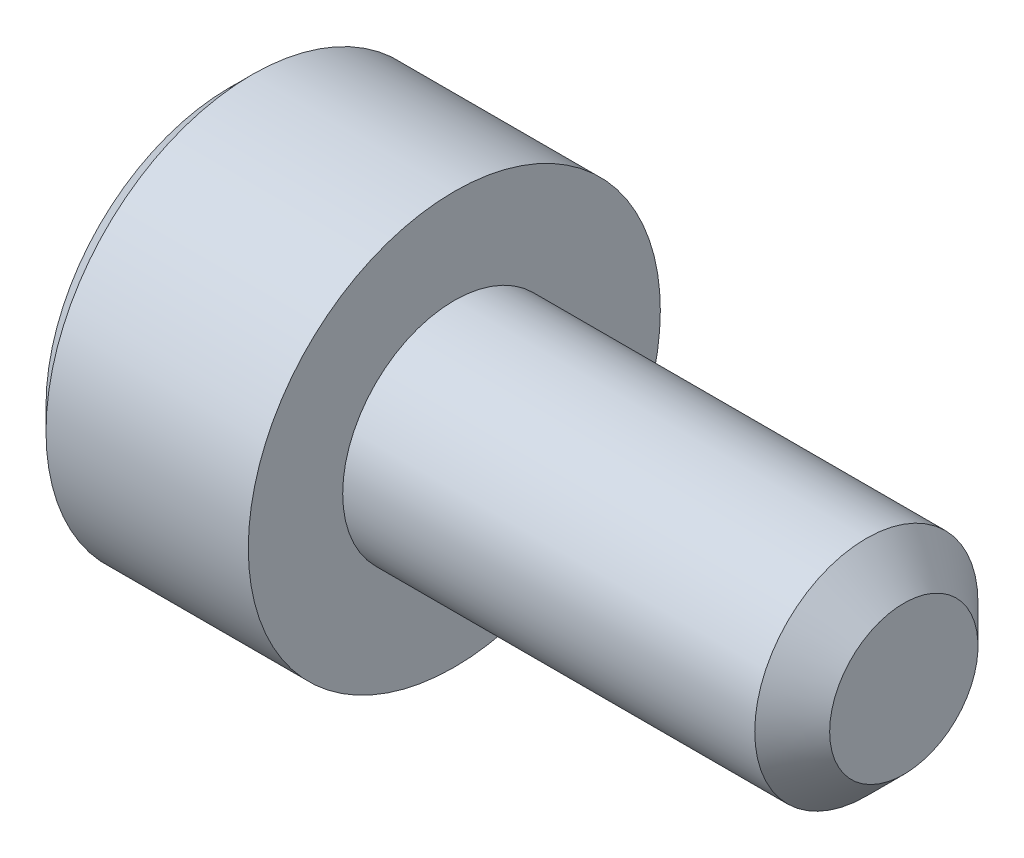
ISO-10303-21;
HEADER;
FILE_DESCRIPTION(('STEP AP214'),'2;1');
FILE_NAME('part.step','',(''),(''),'','','');
FILE_SCHEMA(('AUTOMOTIVE_DESIGN { 1 0 10303 214 1 1 1 1 }'));
ENDSEC;
DATA;
#1=APPLICATION_CONTEXT('core data for automotive mechanical design processes');
#2=APPLICATION_PROTOCOL_DEFINITION('international standard','automotive_design',2000,#1);
#3=PRODUCT_CONTEXT('',#1,'mechanical');
#4=PRODUCT('Part','Part','',(#3));
#5=PRODUCT_RELATED_PRODUCT_CATEGORY('part','',(#4));
#6=PRODUCT_DEFINITION_FORMATION('','',#4);
#7=PRODUCT_DEFINITION_CONTEXT('part definition',#1,'design');
#8=PRODUCT_DEFINITION('design','',#6,#7);
#9=PRODUCT_DEFINITION_SHAPE('','',#8);
#10=(LENGTH_UNIT() NAMED_UNIT(*) SI_UNIT(.MILLI.,.METRE.));
#11=(NAMED_UNIT(*) PLANE_ANGLE_UNIT() SI_UNIT($,.RADIAN.));
#12=(NAMED_UNIT(*) SI_UNIT($,.STERADIAN.) SOLID_ANGLE_UNIT());
#13=UNCERTAINTY_MEASURE_WITH_UNIT(LENGTH_MEASURE(1.E-05),#10,'distance_accuracy_value','');
#14=(GEOMETRIC_REPRESENTATION_CONTEXT(3) GLOBAL_UNCERTAINTY_ASSIGNED_CONTEXT((#13)) GLOBAL_UNIT_ASSIGNED_CONTEXT((#10,
#11,#12)) REPRESENTATION_CONTEXT('',''));
#15=CARTESIAN_POINT('',(0.,0.,0.));
#16=DIRECTION('',(0.,0.,1.));
#17=DIRECTION('',(1.,0.,0.));
#18=AXIS2_PLACEMENT_3D('',#15,#16,#17);
#19=CARTESIAN_POINT('',(0.,0.,0.));
#20=DIRECTION('',(1.,0.,0.));
#21=DIRECTION('',(0.,0.,-1.));
#22=AXIS2_PLACEMENT_3D('',#19,#20,#21);
#23=PLANE('',#22);
#24=DIRECTION('',(0.,0.866025403784439,0.5));
#25=VECTOR('',#24,1.);
#26=CARTESIAN_POINT('',(0.,1.4,-0.981495457622362));
#27=LINE('',#26,#25);
#28=CARTESIAN_POINT('',(0.,0.,-1.78978583448784));
#29=VERTEX_POINT('',#28);
#30=CARTESIAN_POINT('',(0.,1.55,-0.894892917243918));
#31=VERTEX_POINT('',#30);
#32=EDGE_CURVE('E171',#29,#31,#27,.T.);
#33=ORIENTED_EDGE('',*,*,#32,.T.);
#34=DIRECTION('',(0.,0.,1.));
#35=VECTOR('',#34,1.);
#36=CARTESIAN_POINT('',(0.,1.55,0.721687836487032));
#37=LINE('',#36,#35);
#38=CARTESIAN_POINT('',(0.,1.55,0.894892917243919));
#39=VERTEX_POINT('',#38);
#40=EDGE_CURVE('E186',#31,#39,#37,.T.);
#41=ORIENTED_EDGE('',*,*,#40,.T.);
#42=DIRECTION('',(0.,-0.866025403784439,0.5));
#43=VECTOR('',#42,1.);
#44=CARTESIAN_POINT('',(0.,0.15,1.7031832941094));
#45=LINE('',#44,#43);
#46=CARTESIAN_POINT('',(0.,0.,1.78978583448784));
#47=VERTEX_POINT('',#46);
#48=EDGE_CURVE('E183',#39,#47,#45,.T.);
#49=ORIENTED_EDGE('',*,*,#48,.T.);
#50=DIRECTION('',(0.,-0.866025403784439,-0.5));
#51=VECTOR('',#50,1.);
#52=CARTESIAN_POINT('',(0.,-1.4,0.981495457622364));
#53=LINE('',#52,#51);
#54=CARTESIAN_POINT('',(0.,-1.55,0.89489291724392));
#55=VERTEX_POINT('',#54);
#56=EDGE_CURVE('E180',#47,#55,#53,.T.);
#57=ORIENTED_EDGE('',*,*,#56,.T.);
#58=DIRECTION('',(0.,0.,-1.));
#59=VECTOR('',#58,1.);
#60=CARTESIAN_POINT('',(0.,-1.55,-0.721687836487031));
#61=LINE('',#60,#59);
#62=CARTESIAN_POINT('',(0.,-1.55,-0.894892917243919));
#63=VERTEX_POINT('',#62);
#64=EDGE_CURVE('E177',#55,#63,#61,.T.);
#65=ORIENTED_EDGE('',*,*,#64,.T.);
#66=DIRECTION('',(0.,0.866025403784439,-0.5));
#67=VECTOR('',#66,1.);
#68=CARTESIAN_POINT('',(0.,-0.149999999999999,-1.7031832941094));
#69=LINE('',#68,#67);
#70=EDGE_CURVE('E174',#63,#29,#69,.T.);
#71=ORIENTED_EDGE('',*,*,#70,.T.);
#72=EDGE_LOOP('',(#33,#41,#49,#57,#65,#71));
#73=FACE_BOUND('',#72,.T.);
#74=CARTESIAN_POINT('',(0.,0.,0.));
#75=DIRECTION('',(1.,0.,0.));
#76=DIRECTION('',(0.,0.,-1.));
#77=AXIS2_PLACEMENT_3D('',#74,#75,#76);
#78=CIRCLE('',#77,2.44999999999999);
#79=CARTESIAN_POINT('',(0.,0.,-2.44999999999999));
#80=VERTEX_POINT('',#79);
#81=EDGE_CURVE('E163',#80,#80,#78,.F.);
#82=ORIENTED_EDGE('',*,*,#81,.T.);
#83=EDGE_LOOP('',(#82));
#84=FACE_BOUND('',#83,.T.);
#85=ADVANCED_FACE('F39',(#73,#84),#23,.F.);
#86=CARTESIAN_POINT('',(9.,0.,0.));
#87=DIRECTION('',(-1.,0.,0.));
#88=DIRECTION('',(0.,0.,1.));
#89=AXIS2_PLACEMENT_3D('',#86,#87,#88);
#90=PLANE('',#89);
#91=CARTESIAN_POINT('',(9.,0.,0.));
#92=DIRECTION('',(-1.,0.,0.));
#93=DIRECTION('',(0.,0.,1.));
#94=AXIS2_PLACEMENT_3D('',#91,#92,#93);
#95=CIRCLE('',#94,0.990000000000009);
#96=CARTESIAN_POINT('',(9.,0.,0.990000000000009));
#97=VERTEX_POINT('',#96);
#98=EDGE_CURVE('E159',#97,#97,#95,.F.);
#99=ORIENTED_EDGE('',*,*,#98,.T.);
#100=EDGE_LOOP('',(#99));
#101=FACE_BOUND('',#100,.T.);
#102=ADVANCED_FACE('F286',(#101),#90,.F.);
#103=CARTESIAN_POINT('',(-88.7054908485857,0.,0.));
#104=DIRECTION('',(-1.,0.,0.));
#105=DIRECTION('',(0.,0.,1.));
#106=AXIS2_PLACEMENT_3D('',#103,#104,#105);
#107=CYLINDRICAL_SURFACE('',#106,1.49);
#108=CARTESIAN_POINT('',(8.50000000000001,0.,0.));
#109=DIRECTION('',(-1.,0.,0.));
#110=DIRECTION('',(0.,0.,1.));
#111=AXIS2_PLACEMENT_3D('',#108,#109,#110);
#112=CIRCLE('',#111,1.49);
#113=CARTESIAN_POINT('',(8.50000000000001,0.,1.49));
#114=VERTEX_POINT('',#113);
#115=EDGE_CURVE('E155',#114,#114,#112,.T.);
#116=ORIENTED_EDGE('',*,*,#115,.T.);
#117=EDGE_LOOP('',(#116));
#118=FACE_BOUND('',#117,.T.);
#119=CARTESIAN_POINT('',(3.,0.,0.));
#120=DIRECTION('',(-1.,0.,0.));
#121=DIRECTION('',(0.,0.,1.));
#122=AXIS2_PLACEMENT_3D('',#119,#120,#121);
#123=CIRCLE('',#122,1.49);
#124=CARTESIAN_POINT('',(3.,0.,1.49));
#125=VERTEX_POINT('',#124);
#126=EDGE_CURVE('E146',#125,#125,#123,.T.);
#127=ORIENTED_EDGE('',*,*,#126,.F.);
#128=EDGE_LOOP('',(#127));
#129=FACE_BOUND('',#128,.T.);
#130=ADVANCED_FACE('F291',(#118,#129),#107,.T.);
#131=CARTESIAN_POINT('',(3.,1.49,0.));
#132=DIRECTION('',(-1.,0.,0.));
#133=DIRECTION('',(0.,0.,1.));
#134=AXIS2_PLACEMENT_3D('',#131,#132,#133);
#135=PLANE('',#134);
#136=CARTESIAN_POINT('',(3.,0.,0.));
#137=DIRECTION('',(-1.,0.,0.));
#138=DIRECTION('',(0.,0.,1.));
#139=AXIS2_PLACEMENT_3D('',#136,#137,#138);
#140=CIRCLE('',#139,2.75);
#141=CARTESIAN_POINT('',(3.,0.,2.75));
#142=VERTEX_POINT('',#141);
#143=EDGE_CURVE('E140',#142,#142,#140,.T.);
#144=ORIENTED_EDGE('',*,*,#143,.F.);
#145=EDGE_LOOP('',(#144));
#146=FACE_BOUND('',#145,.T.);
#147=ORIENTED_EDGE('',*,*,#126,.T.);
#148=EDGE_LOOP('',(#147));
#149=FACE_BOUND('',#148,.T.);
#150=ADVANCED_FACE('F301',(#146,#149),#135,.F.);
#151=CARTESIAN_POINT('',(-88.7054908485857,0.,0.));
#152=DIRECTION('',(-1.,0.,0.));
#153=DIRECTION('',(0.,0.,1.));
#154=AXIS2_PLACEMENT_3D('',#151,#152,#153);
#155=CYLINDRICAL_SURFACE('',#154,2.75);
#156=CARTESIAN_POINT('',(0.300000000000009,0.,0.));
#157=DIRECTION('',(1.,0.,0.));
#158=DIRECTION('',(0.,0.,-1.));
#159=AXIS2_PLACEMENT_3D('',#156,#157,#158);
#160=CIRCLE('',#159,2.75);
#161=CARTESIAN_POINT('',(0.300000000000009,0.,-2.75));
#162=VERTEX_POINT('',#161);
#163=EDGE_CURVE('E167',#162,#162,#160,.T.);
#164=ORIENTED_EDGE('',*,*,#163,.T.);
#165=EDGE_LOOP('',(#164));
#166=FACE_BOUND('',#165,.T.);
#167=ORIENTED_EDGE('',*,*,#143,.T.);
#168=EDGE_LOOP('',(#167));
#169=FACE_BOUND('',#168,.T.);
#170=ADVANCED_FACE('F297',(#166,#169),#155,.T.);
#171=CARTESIAN_POINT('',(8.50000000000001,0.,0.));
#172=DIRECTION('',(-1.,0.,0.));
#173=DIRECTION('',(0.,0.,1.));
#174=AXIS2_PLACEMENT_3D('',#171,#172,#173);
#175=CONICAL_SURFACE('',#174,1.49,0.785398163397444);
#176=ORIENTED_EDGE('',*,*,#98,.F.);
#177=EDGE_LOOP('',(#176));
#178=FACE_BOUND('',#177,.T.);
#179=ORIENTED_EDGE('',*,*,#115,.F.);
#180=EDGE_LOOP('',(#179));
#181=FACE_BOUND('',#180,.T.);
#182=ADVANCED_FACE('F300',(#178,#181),#175,.T.);
#183=CARTESIAN_POINT('',(0.,0.,0.));
#184=DIRECTION('',(1.,0.,0.));
#185=DIRECTION('',(0.,0.,-1.));
#186=AXIS2_PLACEMENT_3D('',#183,#184,#185);
#187=CONICAL_SURFACE('',#186,2.44999999999999,0.785398163397444);
#188=ORIENTED_EDGE('',*,*,#163,.F.);
#189=EDGE_LOOP('',(#188));
#190=FACE_BOUND('',#189,.T.);
#191=ORIENTED_EDGE('',*,*,#81,.F.);
#192=EDGE_LOOP('',(#191));
#193=FACE_BOUND('',#192,.T.);
#194=ADVANCED_FACE('F311',(#190,#193),#187,.T.);
#195=CARTESIAN_POINT('',(2.5,1.25,0.721687836487032));
#196=DIRECTION('',(0.,-0.5,-0.866025403784438));
#197=DIRECTION('',(0.,0.866025403784439,-0.5));
#198=AXIS2_PLACEMENT_3D('',#195,#196,#197);
#199=PLANE('',#198);
#200=DIRECTION('',(-1.,0.,0.));
#201=VECTOR('',#200,1.);
#202=CARTESIAN_POINT('',(2.5,0.,1.44337567297407));
#203=LINE('',#202,#201);
#204=CARTESIAN_POINT('',(2.5,0.,1.44337567297407));
#205=VERTEX_POINT('',#204);
#206=CARTESIAN_POINT('',(0.3,0.,1.44337567297407));
#207=VERTEX_POINT('',#206);
#208=EDGE_CURVE('E130',#205,#207,#203,.T.);
#209=ORIENTED_EDGE('',*,*,#208,.T.);
#210=DIRECTION('',(0.,0.866025403784439,-0.5));
#211=VECTOR('',#210,1.);
#212=CARTESIAN_POINT('',(0.3,1.25,0.721687836487032));
#213=LINE('',#212,#211);
#214=CARTESIAN_POINT('',(0.3,1.25,0.721687836487032));
#215=VERTEX_POINT('',#214);
#216=EDGE_CURVE('E194',#207,#215,#213,.T.);
#217=ORIENTED_EDGE('',*,*,#216,.T.);
#218=DIRECTION('',(-1.,0.,0.));
#219=VECTOR('',#218,1.);
#220=CARTESIAN_POINT('',(2.5,1.25,0.721687836487032));
#221=LINE('',#220,#219);
#222=CARTESIAN_POINT('',(2.5,1.25,0.721687836487032));
#223=VERTEX_POINT('',#222);
#224=EDGE_CURVE('E133',#223,#215,#221,.T.);
#225=ORIENTED_EDGE('',*,*,#224,.F.);
#226=DIRECTION('',(0.,-0.866025403784439,0.5));
#227=VECTOR('',#226,1.);
#228=CARTESIAN_POINT('',(2.5,1.25,0.721687836487032));
#229=LINE('',#228,#227);
#230=EDGE_CURVE('E117',#223,#205,#229,.T.);
#231=ORIENTED_EDGE('',*,*,#230,.T.);
#232=EDGE_LOOP('',(#209,#217,#225,#231));
#233=FACE_BOUND('',#232,.T.);
#234=ADVANCED_FACE('F129',(#233),#199,.T.);
#235=CARTESIAN_POINT('',(2.5,0.,1.44337567297407));
#236=DIRECTION('',(0.,0.5,-0.866025403784438));
#237=DIRECTION('',(0.,0.866025403784439,0.5));
#238=AXIS2_PLACEMENT_3D('',#235,#236,#237);
#239=PLANE('',#238);
#240=DIRECTION('',(-1.,0.,0.));
#241=VECTOR('',#240,1.);
#242=CARTESIAN_POINT('',(2.5,-1.25,0.721687836487033));
#243=LINE('',#242,#241);
#244=CARTESIAN_POINT('',(2.5,-1.25,0.721687836487033));
#245=VERTEX_POINT('',#244);
#246=CARTESIAN_POINT('',(0.3,-1.25,0.721687836487033));
#247=VERTEX_POINT('',#246);
#248=EDGE_CURVE('E141',#245,#247,#243,.T.);
#249=ORIENTED_EDGE('',*,*,#248,.T.);
#250=DIRECTION('',(0.,0.866025403784439,0.5));
#251=VECTOR('',#250,1.);
#252=CARTESIAN_POINT('',(0.3,0.,1.44337567297407));
#253=LINE('',#252,#251);
#254=EDGE_CURVE('E138',#247,#207,#253,.T.);
#255=ORIENTED_EDGE('',*,*,#254,.T.);
#256=ORIENTED_EDGE('',*,*,#208,.F.);
#257=DIRECTION('',(0.,-0.866025403784439,-0.5));
#258=VECTOR('',#257,1.);
#259=CARTESIAN_POINT('',(2.5,0.,1.44337567297407));
#260=LINE('',#259,#258);
#261=EDGE_CURVE('E113',#205,#245,#260,.T.);
#262=ORIENTED_EDGE('',*,*,#261,.T.);
#263=EDGE_LOOP('',(#249,#255,#256,#262));
#264=FACE_BOUND('',#263,.T.);
#265=ADVANCED_FACE('F136',(#264),#239,.T.);
#266=CARTESIAN_POINT('',(2.5,-1.25,0.721687836487033));
#267=DIRECTION('',(0.,1.,0.));
#268=DIRECTION('',(0.,0.,1.));
#269=AXIS2_PLACEMENT_3D('',#266,#267,#268);
#270=PLANE('',#269);
#271=DIRECTION('',(-1.,0.,0.));
#272=VECTOR('',#271,1.);
#273=CARTESIAN_POINT('',(2.5,-1.25,-0.721687836487031));
#274=LINE('',#273,#272);
#275=CARTESIAN_POINT('',(2.5,-1.25,-0.721687836487031));
#276=VERTEX_POINT('',#275);
#277=CARTESIAN_POINT('',(0.3,-1.25,-0.721687836487031));
#278=VERTEX_POINT('',#277);
#279=EDGE_CURVE('E148',#276,#278,#274,.T.);
#280=ORIENTED_EDGE('',*,*,#279,.T.);
#281=DIRECTION('',(0.,0.,1.));
#282=VECTOR('',#281,1.);
#283=CARTESIAN_POINT('',(0.3,-1.25,0.721687836487033));
#284=LINE('',#283,#282);
#285=EDGE_CURVE('E199',#278,#247,#284,.T.);
#286=ORIENTED_EDGE('',*,*,#285,.T.);
#287=ORIENTED_EDGE('',*,*,#248,.F.);
#288=DIRECTION('',(0.,0.,-1.));
#289=VECTOR('',#288,1.);
#290=CARTESIAN_POINT('',(2.5,-1.25,0.721687836487033));
#291=LINE('',#290,#289);
#292=EDGE_CURVE('E119',#245,#276,#291,.T.);
#293=ORIENTED_EDGE('',*,*,#292,.T.);
#294=EDGE_LOOP('',(#280,#286,#287,#293));
#295=FACE_BOUND('',#294,.T.);
#296=ADVANCED_FACE('F234',(#295),#270,.T.);
#297=CARTESIAN_POINT('',(2.5,-1.25,-0.721687836487031));
#298=DIRECTION('',(0.,0.5,0.866025403784439));
#299=DIRECTION('',(0.,-0.866025403784439,0.5));
#300=AXIS2_PLACEMENT_3D('',#297,#298,#299);
#301=PLANE('',#300);
#302=DIRECTION('',(-1.,0.,0.));
#303=VECTOR('',#302,1.);
#304=CARTESIAN_POINT('',(2.5,0.,-1.44337567297406));
#305=LINE('',#304,#303);
#306=CARTESIAN_POINT('',(2.5,0.,-1.44337567297406));
#307=VERTEX_POINT('',#306);
#308=CARTESIAN_POINT('',(0.3,0.,-1.44337567297406));
#309=VERTEX_POINT('',#308);
#310=EDGE_CURVE('E236',#307,#309,#305,.T.);
#311=ORIENTED_EDGE('',*,*,#310,.T.);
#312=DIRECTION('',(0.,-0.866025403784439,0.5));
#313=VECTOR('',#312,1.);
#314=CARTESIAN_POINT('',(0.3,-1.25,-0.721687836487031));
#315=LINE('',#314,#313);
#316=EDGE_CURVE('E49',#309,#278,#315,.T.);
#317=ORIENTED_EDGE('',*,*,#316,.T.);
#318=ORIENTED_EDGE('',*,*,#279,.F.);
#319=DIRECTION('',(0.,0.866025403784439,-0.499999999999999));
#320=VECTOR('',#319,1.);
#321=CARTESIAN_POINT('',(2.5,-1.25,-0.721687836487031));
#322=LINE('',#321,#320);
#323=EDGE_CURVE('E251',#276,#307,#322,.T.);
#324=ORIENTED_EDGE('',*,*,#323,.T.);
#325=EDGE_LOOP('',(#311,#317,#318,#324));
#326=FACE_BOUND('',#325,.T.);
#327=ADVANCED_FACE('F255',(#326),#301,.T.);
#328=CARTESIAN_POINT('',(2.5,0.,-1.44337567297406));
#329=DIRECTION('',(0.,-0.5,0.866025403784439));
#330=DIRECTION('',(0.,-0.866025403784439,-0.5));
#331=AXIS2_PLACEMENT_3D('',#328,#329,#330);
#332=PLANE('',#331);
#333=DIRECTION('',(-1.,0.,0.));
#334=VECTOR('',#333,1.);
#335=CARTESIAN_POINT('',(2.5,1.25,-0.72168783648703));
#336=LINE('',#335,#334);
#337=CARTESIAN_POINT('',(2.5,1.25,-0.72168783648703));
#338=VERTEX_POINT('',#337);
#339=CARTESIAN_POINT('',(0.3,1.25,-0.72168783648703));
#340=VERTEX_POINT('',#339);
#341=EDGE_CURVE('E238',#338,#340,#336,.T.);
#342=ORIENTED_EDGE('',*,*,#341,.T.);
#343=DIRECTION('',(0.,-0.866025403784439,-0.5));
#344=VECTOR('',#343,1.);
#345=CARTESIAN_POINT('',(0.3,0.,-1.44337567297406));
#346=LINE('',#345,#344);
#347=EDGE_CURVE('E11',#340,#309,#346,.T.);
#348=ORIENTED_EDGE('',*,*,#347,.T.);
#349=ORIENTED_EDGE('',*,*,#310,.F.);
#350=DIRECTION('',(0.,0.866025403784438,0.5));
#351=VECTOR('',#350,1.);
#352=CARTESIAN_POINT('',(2.5,0.,-1.44337567297406));
#353=LINE('',#352,#351);
#354=EDGE_CURVE('E248',#307,#338,#353,.T.);
#355=ORIENTED_EDGE('',*,*,#354,.T.);
#356=EDGE_LOOP('',(#342,#348,#349,#355));
#357=FACE_BOUND('',#356,.T.);
#358=ADVANCED_FACE('F257',(#357),#332,.T.);
#359=CARTESIAN_POINT('',(2.5,1.25,-0.72168783648703));
#360=DIRECTION('',(0.,-1.,0.));
#361=DIRECTION('',(0.,0.,-1.));
#362=AXIS2_PLACEMENT_3D('',#359,#360,#361);
#363=PLANE('',#362);
#364=ORIENTED_EDGE('',*,*,#224,.T.);
#365=DIRECTION('',(0.,0.,-1.));
#366=VECTOR('',#365,1.);
#367=CARTESIAN_POINT('',(0.3,1.25,-0.72168783648703));
#368=LINE('',#367,#366);
#369=EDGE_CURVE('E190',#215,#340,#368,.T.);
#370=ORIENTED_EDGE('',*,*,#369,.T.);
#371=ORIENTED_EDGE('',*,*,#341,.F.);
#372=DIRECTION('',(0.,0.,1.));
#373=VECTOR('',#372,1.);
#374=CARTESIAN_POINT('',(2.5,1.25,-0.72168783648703));
#375=LINE('',#374,#373);
#376=EDGE_CURVE('E245',#338,#223,#375,.T.);
#377=ORIENTED_EDGE('',*,*,#376,.T.);
#378=EDGE_LOOP('',(#364,#370,#371,#377));
#379=FACE_BOUND('',#378,.T.);
#380=ADVANCED_FACE('F260',(#379),#363,.T.);
#381=CARTESIAN_POINT('',(2.5,0.,0.));
#382=DIRECTION('',(1.,0.,0.));
#383=DIRECTION('',(0.,0.,-1.));
#384=AXIS2_PLACEMENT_3D('',#381,#382,#383);
#385=PLANE('',#384);
#386=ORIENTED_EDGE('',*,*,#230,.F.);
#387=ORIENTED_EDGE('',*,*,#376,.F.);
#388=ORIENTED_EDGE('',*,*,#354,.F.);
#389=ORIENTED_EDGE('',*,*,#323,.F.);
#390=ORIENTED_EDGE('',*,*,#292,.F.);
#391=ORIENTED_EDGE('',*,*,#261,.F.);
#392=EDGE_LOOP('',(#386,#387,#388,#389,#390,#391));
#393=FACE_BOUND('',#392,.T.);
#394=ADVANCED_FACE('F115',(#393),#385,.F.);
#395=CARTESIAN_POINT('',(0.,-1.55,0.));
#396=DIRECTION('',(-0.707106781186547,0.707106781186547,0.));
#397=DIRECTION('',(0.,0.,1.));
#398=AXIS2_PLACEMENT_3D('',#395,#396,#397);
#399=PLANE('',#398);
#400=DIRECTION('',(0.654653670707977,0.654653670707977,-0.377964473009227));
#401=VECTOR('',#400,1.);
#402=CARTESIAN_POINT('',(0.221428571428572,-1.32857142857143,0.76705107192336));
#403=LINE('',#402,#401);
#404=EDGE_CURVE('E217',#247,#55,#403,.F.);
#405=ORIENTED_EDGE('',*,*,#404,.F.);
#406=ORIENTED_EDGE('',*,*,#285,.F.);
#407=DIRECTION('',(0.654653670707977,0.654653670707977,0.377964473009227));
#408=VECTOR('',#407,1.);
#409=CARTESIAN_POINT('',(0.221428571428571,-1.32857142857143,-0.767051071923359));
#410=LINE('',#409,#408);
#411=EDGE_CURVE('E43',#63,#278,#410,.T.);
#412=ORIENTED_EDGE('',*,*,#411,.F.);
#413=ORIENTED_EDGE('',*,*,#64,.F.);
#414=EDGE_LOOP('',(#405,#406,#412,#413));
#415=FACE_BOUND('',#414,.T.);
#416=ADVANCED_FACE('F41',(#415),#399,.T.);
#417=CARTESIAN_POINT('',(0.,-0.774999999999999,-1.34233937586588));
#418=DIRECTION('',(-0.707106781186547,0.353553390593273,0.612372435695795));
#419=DIRECTION('',(0.,-0.866025403784439,0.5));
#420=AXIS2_PLACEMENT_3D('',#417,#418,#419);
#421=PLANE('',#420);
#422=ORIENTED_EDGE('',*,*,#411,.T.);
#423=ORIENTED_EDGE('',*,*,#316,.F.);
#424=DIRECTION('',(0.654653670707977,0.,0.755928946018454));
#425=VECTOR('',#424,1.);
#426=CARTESIAN_POINT('',(0.221428571428571,0.,-1.53410214384672));
#427=LINE('',#426,#425);
#428=EDGE_CURVE('E214',#29,#309,#427,.T.);
#429=ORIENTED_EDGE('',*,*,#428,.F.);
#430=ORIENTED_EDGE('',*,*,#70,.F.);
#431=EDGE_LOOP('',(#422,#423,#429,#430));
#432=FACE_BOUND('',#431,.T.);
#433=ADVANCED_FACE('F228',(#432),#421,.T.);
#434=CARTESIAN_POINT('',(0.,-0.775000000000001,1.34233937586588));
#435=DIRECTION('',(-0.707106781186547,0.353553390593274,-0.612372435695795));
#436=DIRECTION('',(0.,0.866025403784439,0.5));
#437=AXIS2_PLACEMENT_3D('',#434,#435,#436);
#438=PLANE('',#437);
#439=ORIENTED_EDGE('',*,*,#404,.T.);
#440=ORIENTED_EDGE('',*,*,#56,.F.);
#441=DIRECTION('',(0.654653670707977,0.,-0.755928946018454));
#442=VECTOR('',#441,1.);
#443=CARTESIAN_POINT('',(0.221428571428572,0.,1.53410214384672));
#444=LINE('',#443,#442);
#445=EDGE_CURVE('E210',#207,#47,#444,.F.);
#446=ORIENTED_EDGE('',*,*,#445,.F.);
#447=ORIENTED_EDGE('',*,*,#254,.F.);
#448=EDGE_LOOP('',(#439,#440,#446,#447));
#449=FACE_BOUND('',#448,.T.);
#450=ADVANCED_FACE('F277',(#449),#438,.T.);
#451=CARTESIAN_POINT('',(0.,0.775,-1.34233937586588));
#452=DIRECTION('',(-0.707106781186548,-0.353553390593274,0.612372435695794));
#453=DIRECTION('',(0.,-0.866025403784439,-0.5));
#454=AXIS2_PLACEMENT_3D('',#451,#452,#453);
#455=PLANE('',#454);
#456=ORIENTED_EDGE('',*,*,#428,.T.);
#457=ORIENTED_EDGE('',*,*,#347,.F.);
#458=DIRECTION('',(-0.654653670707977,0.654653670707977,-0.377964473009227));
#459=VECTOR('',#458,1.);
#460=CARTESIAN_POINT('',(0.221428571428571,1.32857142857143,-0.767051071923358));
#461=LINE('',#460,#459);
#462=EDGE_CURVE('E207',#31,#340,#461,.F.);
#463=ORIENTED_EDGE('',*,*,#462,.F.);
#464=ORIENTED_EDGE('',*,*,#32,.F.);
#465=EDGE_LOOP('',(#456,#457,#463,#464));
#466=FACE_BOUND('',#465,.T.);
#467=ADVANCED_FACE('F275',(#466),#455,.T.);
#468=CARTESIAN_POINT('',(0.,0.775,1.34233937586588));
#469=DIRECTION('',(-0.707106781186547,-0.353553390593274,-0.612372435695795));
#470=DIRECTION('',(0.,0.866025403784439,-0.5));
#471=AXIS2_PLACEMENT_3D('',#468,#469,#470);
#472=PLANE('',#471);
#473=ORIENTED_EDGE('',*,*,#445,.T.);
#474=ORIENTED_EDGE('',*,*,#48,.F.);
#475=DIRECTION('',(0.654653670707977,-0.654653670707977,-0.377964473009227));
#476=VECTOR('',#475,1.);
#477=CARTESIAN_POINT('',(0.221428571428571,1.32857142857143,0.76705107192336));
#478=LINE('',#477,#476);
#479=EDGE_CURVE('E204',#215,#39,#478,.F.);
#480=ORIENTED_EDGE('',*,*,#479,.F.);
#481=ORIENTED_EDGE('',*,*,#216,.F.);
#482=EDGE_LOOP('',(#473,#474,#480,#481));
#483=FACE_BOUND('',#482,.T.);
#484=ADVANCED_FACE('F270',(#483),#472,.T.);
#485=CARTESIAN_POINT('',(0.,1.55,0.));
#486=DIRECTION('',(-0.707106781186547,-0.707106781186547,0.));
#487=DIRECTION('',(0.,0.,-1.));
#488=AXIS2_PLACEMENT_3D('',#485,#486,#487);
#489=PLANE('',#488);
#490=ORIENTED_EDGE('',*,*,#462,.T.);
#491=ORIENTED_EDGE('',*,*,#369,.F.);
#492=ORIENTED_EDGE('',*,*,#479,.T.);
#493=ORIENTED_EDGE('',*,*,#40,.F.);
#494=EDGE_LOOP('',(#490,#491,#492,#493));
#495=FACE_BOUND('',#494,.T.);
#496=ADVANCED_FACE('F264',(#495),#489,.T.);
#497=CLOSED_SHELL('',(#85,#102,#130,#150,#170,#182,#194,#234,#265,#296,#327,#358,#380,#394,#416,
#433,#450,#467,#484,#496));
#498=MANIFOLD_SOLID_BREP('B2',#497);
#499=ADVANCED_BREP_SHAPE_REPRESENTATION('',(#18,#498),#14);
#500=SHAPE_DEFINITION_REPRESENTATION(#9,#499);
ENDSEC;
END-ISO-10303-21;
